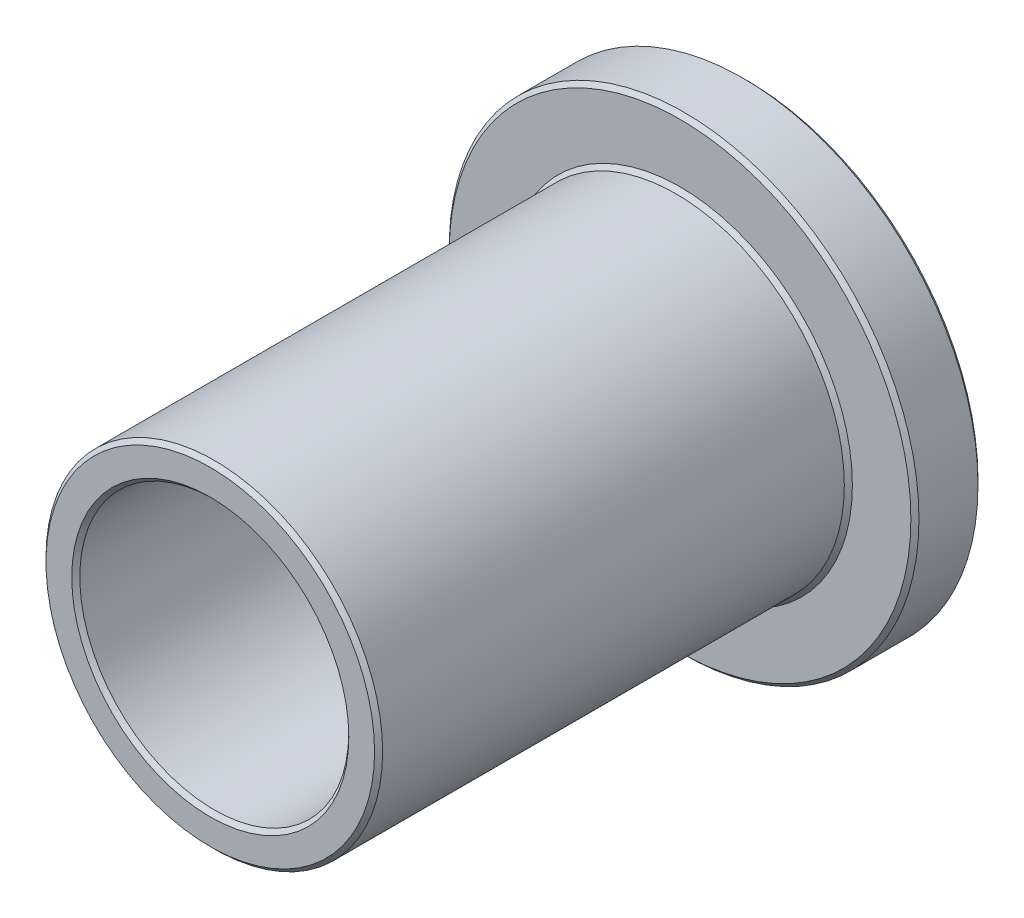
ISO-10303-21;
HEADER;
FILE_DESCRIPTION(('STEP AP214'),'2;1');
FILE_NAME('part.step','',(''),(''),'','','');
FILE_SCHEMA(('AUTOMOTIVE_DESIGN { 1 0 10303 214 1 1 1 1 }'));
ENDSEC;
DATA;
#1=APPLICATION_CONTEXT('core data for automotive mechanical design processes');
#2=APPLICATION_PROTOCOL_DEFINITION('international standard','automotive_design',2000,#1);
#3=PRODUCT_CONTEXT('',#1,'mechanical');
#4=PRODUCT('Part','Part','',(#3));
#5=PRODUCT_RELATED_PRODUCT_CATEGORY('part','',(#4));
#6=PRODUCT_DEFINITION_FORMATION('','',#4);
#7=PRODUCT_DEFINITION_CONTEXT('part definition',#1,'design');
#8=PRODUCT_DEFINITION('design','',#6,#7);
#9=PRODUCT_DEFINITION_SHAPE('','',#8);
#10=(LENGTH_UNIT() NAMED_UNIT(*) SI_UNIT(.MILLI.,.METRE.));
#11=(NAMED_UNIT(*) PLANE_ANGLE_UNIT() SI_UNIT($,.RADIAN.));
#12=(NAMED_UNIT(*) SI_UNIT($,.STERADIAN.) SOLID_ANGLE_UNIT());
#13=UNCERTAINTY_MEASURE_WITH_UNIT(LENGTH_MEASURE(1.E-05),#10,'distance_accuracy_value','');
#14=(GEOMETRIC_REPRESENTATION_CONTEXT(3) GLOBAL_UNCERTAINTY_ASSIGNED_CONTEXT((#13)) GLOBAL_UNIT_ASSIGNED_CONTEXT((#10,
#11,#12)) REPRESENTATION_CONTEXT('',''));
#15=CARTESIAN_POINT('',(0.,0.,0.));
#16=DIRECTION('',(0.,0.,1.));
#17=DIRECTION('',(1.,0.,0.));
#18=AXIS2_PLACEMENT_3D('',#15,#16,#17);
#19=CARTESIAN_POINT('',(0.,0.,-9.525));
#20=DIRECTION('',(0.,0.,-1.));
#21=DIRECTION('',(1.,0.,0.));
#22=AXIS2_PLACEMENT_3D('',#19,#20,#21);
#23=CYLINDRICAL_SURFACE('',#22,11.1125);
#24=CARTESIAN_POINT('',(0.,0.,-12.509119));
#25=DIRECTION('',(0.,0.,1.));
#26=DIRECTION('',(1.,0.,0.));
#27=AXIS2_PLACEMENT_3D('',#24,#25,#26);
#28=CIRCLE('',#27,11.1125);
#29=CARTESIAN_POINT('',(11.1125,0.,-12.509119));
#30=VERTEX_POINT('',#29);
#31=EDGE_CURVE('E61',#30,#30,#28,.F.);
#32=ORIENTED_EDGE('',*,*,#31,.F.);
#33=EDGE_LOOP('',(#32));
#34=FACE_BOUND('',#33,.T.);
#35=CARTESIAN_POINT('',(0.,0.,-9.71588100000001));
#36=DIRECTION('',(0.,0.,1.));
#37=DIRECTION('',(1.,0.,0.));
#38=AXIS2_PLACEMENT_3D('',#35,#36,#37);
#39=CIRCLE('',#38,11.1125);
#40=CARTESIAN_POINT('',(11.1125,0.,-9.71588100000001));
#41=VERTEX_POINT('',#40);
#42=EDGE_CURVE('E64',#41,#41,#39,.T.);
#43=ORIENTED_EDGE('',*,*,#42,.F.);
#44=EDGE_LOOP('',(#43));
#45=FACE_BOUND('',#44,.T.);
#46=ADVANCED_FACE('F35',(#34,#45),#23,.T.);
#47=CARTESIAN_POINT('',(0.,0.,-9.525));
#48=DIRECTION('',(0.,0.,-1.));
#49=DIRECTION('',(1.,0.,0.));
#50=AXIS2_PLACEMENT_3D('',#47,#48,#49);
#51=PLANE('',#50);
#52=CARTESIAN_POINT('',(0.,0.,-9.525));
#53=DIRECTION('',(0.,0.,1.));
#54=DIRECTION('',(1.,0.,0.));
#55=AXIS2_PLACEMENT_3D('',#52,#53,#54);
#56=CIRCLE('',#55,10.921619);
#57=CARTESIAN_POINT('',(10.921619,0.,-9.525));
#58=VERTEX_POINT('',#57);
#59=EDGE_CURVE('E55',#58,#58,#56,.F.);
#60=ORIENTED_EDGE('',*,*,#59,.F.);
#61=EDGE_LOOP('',(#60));
#62=FACE_BOUND('',#61,.T.);
#63=CARTESIAN_POINT('',(0.,0.,-9.525));
#64=DIRECTION('',(0.,0.,1.));
#65=DIRECTION('',(1.,0.,0.));
#66=AXIS2_PLACEMENT_3D('',#63,#64,#65);
#67=CIRCLE('',#66,8.153781);
#68=CARTESIAN_POINT('',(8.153781,0.,-9.525));
#69=VERTEX_POINT('',#68);
#70=EDGE_CURVE('E58',#69,#69,#67,.T.);
#71=ORIENTED_EDGE('',*,*,#70,.F.);
#72=EDGE_LOOP('',(#71));
#73=FACE_BOUND('',#72,.T.);
#74=ADVANCED_FACE('F95',(#62,#73),#51,.F.);
#75=CARTESIAN_POINT('',(0.,0.,-12.7));
#76=DIRECTION('',(0.,0.,-1.));
#77=DIRECTION('',(1.,0.,0.));
#78=AXIS2_PLACEMENT_3D('',#75,#76,#77);
#79=PLANE('',#78);
#80=CARTESIAN_POINT('',(0.,0.,-12.7));
#81=DIRECTION('',(0.,0.,1.));
#82=DIRECTION('',(1.,0.,0.));
#83=AXIS2_PLACEMENT_3D('',#80,#81,#82);
#84=CIRCLE('',#83,6.55358100000001);
#85=CARTESIAN_POINT('',(6.55358100000001,0.,-12.7));
#86=VERTEX_POINT('',#85);
#87=EDGE_CURVE('E67',#86,#86,#84,.F.);
#88=ORIENTED_EDGE('',*,*,#87,.F.);
#89=EDGE_LOOP('',(#88));
#90=FACE_BOUND('',#89,.T.);
#91=CARTESIAN_POINT('',(0.,0.,-12.7));
#92=DIRECTION('',(0.,0.,1.));
#93=DIRECTION('',(1.,0.,0.));
#94=AXIS2_PLACEMENT_3D('',#91,#92,#93);
#95=CIRCLE('',#94,10.921619);
#96=CARTESIAN_POINT('',(10.921619,0.,-12.7));
#97=VERTEX_POINT('',#96);
#98=EDGE_CURVE('E70',#97,#97,#95,.T.);
#99=ORIENTED_EDGE('',*,*,#98,.F.);
#100=EDGE_LOOP('',(#99));
#101=FACE_BOUND('',#100,.T.);
#102=ADVANCED_FACE('F85',(#90,#101),#79,.T.);
#103=CARTESIAN_POINT('',(0.,0.,-9.525));
#104=DIRECTION('',(0.,0.,-1.));
#105=DIRECTION('',(1.,0.,0.));
#106=AXIS2_PLACEMENT_3D('',#103,#104,#105);
#107=CYLINDRICAL_SURFACE('',#106,6.3627);
#108=CARTESIAN_POINT('',(0.,0.,-12.509119));
#109=DIRECTION('',(0.,0.,1.));
#110=DIRECTION('',(1.,0.,0.));
#111=AXIS2_PLACEMENT_3D('',#108,#109,#110);
#112=CIRCLE('',#111,6.3627);
#113=CARTESIAN_POINT('',(6.3627,0.,-12.509119));
#114=VERTEX_POINT('',#113);
#115=EDGE_CURVE('E73',#114,#114,#112,.T.);
#116=ORIENTED_EDGE('',*,*,#115,.F.);
#117=EDGE_LOOP('',(#116));
#118=FACE_BOUND('',#117,.T.);
#119=CARTESIAN_POINT('',(0.,0.,12.509119));
#120=DIRECTION('',(0.,0.,1.));
#121=DIRECTION('',(1.,0.,0.));
#122=AXIS2_PLACEMENT_3D('',#119,#120,#121);
#123=CIRCLE('',#122,6.3627);
#124=CARTESIAN_POINT('',(6.3627,0.,12.509119));
#125=VERTEX_POINT('',#124);
#126=EDGE_CURVE('E76',#125,#125,#123,.F.);
#127=ORIENTED_EDGE('',*,*,#126,.F.);
#128=EDGE_LOOP('',(#127));
#129=FACE_BOUND('',#128,.T.);
#130=ADVANCED_FACE('F82',(#118,#129),#107,.F.);
#131=CARTESIAN_POINT('',(0.,0.,12.7));
#132=DIRECTION('',(0.,0.,-1.));
#133=DIRECTION('',(1.,0.,0.));
#134=AXIS2_PLACEMENT_3D('',#131,#132,#133);
#135=CYLINDRICAL_SURFACE('',#134,7.9629);
#136=CARTESIAN_POINT('',(0.,0.,-9.334119));
#137=DIRECTION('',(0.,0.,1.));
#138=DIRECTION('',(1.,0.,0.));
#139=AXIS2_PLACEMENT_3D('',#136,#137,#138);
#140=CIRCLE('',#139,7.9629);
#141=CARTESIAN_POINT('',(7.9629,0.,-9.334119));
#142=VERTEX_POINT('',#141);
#143=EDGE_CURVE('E46',#142,#142,#140,.F.);
#144=ORIENTED_EDGE('',*,*,#143,.F.);
#145=EDGE_LOOP('',(#144));
#146=FACE_BOUND('',#145,.T.);
#147=CARTESIAN_POINT('',(0.,0.,12.509119));
#148=DIRECTION('',(0.,0.,1.));
#149=DIRECTION('',(1.,0.,0.));
#150=AXIS2_PLACEMENT_3D('',#147,#148,#149);
#151=CIRCLE('',#150,7.9629);
#152=CARTESIAN_POINT('',(7.9629,0.,12.509119));
#153=VERTEX_POINT('',#152);
#154=EDGE_CURVE('E50',#153,#153,#151,.T.);
#155=ORIENTED_EDGE('',*,*,#154,.F.);
#156=EDGE_LOOP('',(#155));
#157=FACE_BOUND('',#156,.T.);
#158=ADVANCED_FACE('F84',(#146,#157),#135,.T.);
#159=CARTESIAN_POINT('',(0.,0.,12.7));
#160=DIRECTION('',(0.,0.,-1.));
#161=DIRECTION('',(1.,0.,0.));
#162=AXIS2_PLACEMENT_3D('',#159,#160,#161);
#163=PLANE('',#162);
#164=CARTESIAN_POINT('',(0.,0.,12.7));
#165=DIRECTION('',(0.,0.,1.));
#166=DIRECTION('',(1.,0.,0.));
#167=AXIS2_PLACEMENT_3D('',#164,#165,#166);
#168=CIRCLE('',#167,6.553581);
#169=CARTESIAN_POINT('',(6.553581,0.,12.7));
#170=VERTEX_POINT('',#169);
#171=EDGE_CURVE('E10',#170,#170,#168,.T.);
#172=ORIENTED_EDGE('',*,*,#171,.F.);
#173=EDGE_LOOP('',(#172));
#174=FACE_BOUND('',#173,.T.);
#175=CARTESIAN_POINT('',(0.,0.,12.7));
#176=DIRECTION('',(0.,0.,1.));
#177=DIRECTION('',(1.,0.,0.));
#178=AXIS2_PLACEMENT_3D('',#175,#176,#177);
#179=CIRCLE('',#178,7.772019);
#180=CARTESIAN_POINT('',(7.772019,0.,12.7));
#181=VERTEX_POINT('',#180);
#182=EDGE_CURVE('E42',#181,#181,#179,.F.);
#183=ORIENTED_EDGE('',*,*,#182,.F.);
#184=EDGE_LOOP('',(#183));
#185=FACE_BOUND('',#184,.T.);
#186=ADVANCED_FACE('F92',(#174,#185),#163,.F.);
#187=CARTESIAN_POINT('',(0.,0.,-12.509119));
#188=DIRECTION('',(0.,0.,-1.));
#189=DIRECTION('',(1.,0.,0.));
#190=AXIS2_PLACEMENT_3D('',#187,#188,#189);
#191=CONICAL_SURFACE('',#190,6.3627,0.785398163397451);
#192=ORIENTED_EDGE('',*,*,#87,.T.);
#193=EDGE_LOOP('',(#192));
#194=FACE_BOUND('',#193,.T.);
#195=ORIENTED_EDGE('',*,*,#115,.T.);
#196=EDGE_LOOP('',(#195));
#197=FACE_BOUND('',#196,.T.);
#198=ADVANCED_FACE('F110',(#194,#197),#191,.F.);
#199=CARTESIAN_POINT('',(0.,0.,-12.7));
#200=DIRECTION('',(0.,0.,1.));
#201=DIRECTION('',(-1.,0.,0.));
#202=AXIS2_PLACEMENT_3D('',#199,#200,#201);
#203=CONICAL_SURFACE('',#202,10.921619,0.785398163397448);
#204=ORIENTED_EDGE('',*,*,#31,.T.);
#205=EDGE_LOOP('',(#204));
#206=FACE_BOUND('',#205,.T.);
#207=ORIENTED_EDGE('',*,*,#98,.T.);
#208=EDGE_LOOP('',(#207));
#209=FACE_BOUND('',#208,.T.);
#210=ADVANCED_FACE('F113',(#206,#209),#203,.T.);
#211=CARTESIAN_POINT('',(0.,0.,-9.71588100000001));
#212=DIRECTION('',(0.,0.,-1.));
#213=DIRECTION('',(1.,0.,0.));
#214=AXIS2_PLACEMENT_3D('',#211,#212,#213);
#215=CONICAL_SURFACE('',#214,11.1125,0.785398163397439);
#216=ORIENTED_EDGE('',*,*,#59,.T.);
#217=EDGE_LOOP('',(#216));
#218=FACE_BOUND('',#217,.T.);
#219=ORIENTED_EDGE('',*,*,#42,.T.);
#220=EDGE_LOOP('',(#219));
#221=FACE_BOUND('',#220,.T.);
#222=ADVANCED_FACE('F117',(#218,#221),#215,.T.);
#223=CARTESIAN_POINT('',(0.,0.,-9.525));
#224=DIRECTION('',(0.,0.,-1.));
#225=DIRECTION('',(1.,0.,0.));
#226=AXIS2_PLACEMENT_3D('',#223,#224,#225);
#227=CONICAL_SURFACE('',#226,8.153781,0.785398163397453);
#228=ORIENTED_EDGE('',*,*,#143,.T.);
#229=EDGE_LOOP('',(#228));
#230=FACE_BOUND('',#229,.T.);
#231=ORIENTED_EDGE('',*,*,#70,.T.);
#232=EDGE_LOOP('',(#231));
#233=FACE_BOUND('',#232,.T.);
#234=ADVANCED_FACE('F121',(#230,#233),#227,.T.);
#235=CARTESIAN_POINT('',(0.,0.,12.7));
#236=DIRECTION('',(0.,0.,1.));
#237=DIRECTION('',(-1.,0.,0.));
#238=AXIS2_PLACEMENT_3D('',#235,#236,#237);
#239=CONICAL_SURFACE('',#238,6.553581,0.785398163397455);
#240=ORIENTED_EDGE('',*,*,#126,.T.);
#241=EDGE_LOOP('',(#240));
#242=FACE_BOUND('',#241,.T.);
#243=ORIENTED_EDGE('',*,*,#171,.T.);
#244=EDGE_LOOP('',(#243));
#245=FACE_BOUND('',#244,.T.);
#246=ADVANCED_FACE('F80',(#242,#245),#239,.F.);
#247=CARTESIAN_POINT('',(0.,0.,12.509119));
#248=DIRECTION('',(0.,0.,-1.));
#249=DIRECTION('',(1.,0.,0.));
#250=AXIS2_PLACEMENT_3D('',#247,#248,#249);
#251=CONICAL_SURFACE('',#250,7.9629,0.785398163397457);
#252=ORIENTED_EDGE('',*,*,#182,.T.);
#253=EDGE_LOOP('',(#252));
#254=FACE_BOUND('',#253,.T.);
#255=ORIENTED_EDGE('',*,*,#154,.T.);
#256=EDGE_LOOP('',(#255));
#257=FACE_BOUND('',#256,.T.);
#258=ADVANCED_FACE('F37',(#254,#257),#251,.T.);
#259=CLOSED_SHELL('',(#46,#74,#102,#130,#158,#186,#198,#210,#222,#234,#246,#258));
#260=MANIFOLD_SOLID_BREP('B2',#259);
#261=ADVANCED_BREP_SHAPE_REPRESENTATION('',(#18,#260),#14);
#262=SHAPE_DEFINITION_REPRESENTATION(#9,#261);
ENDSEC;
END-ISO-10303-21;
